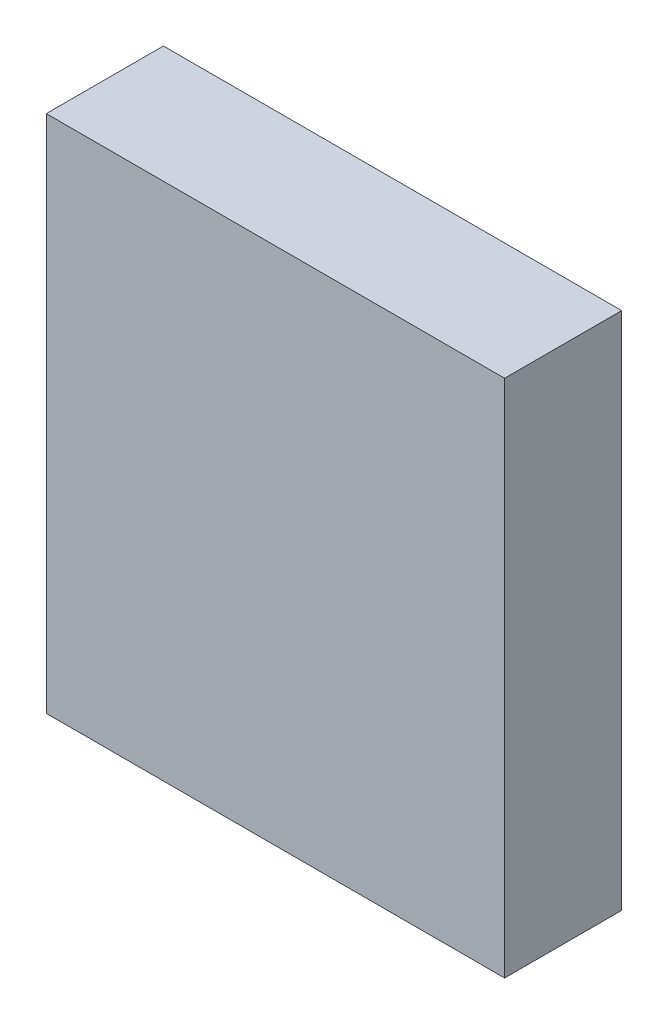
ISO-10303-21;
HEADER;
FILE_DESCRIPTION(('STEP AP214'),'2;1');
FILE_NAME('part.step','',(''),(''),'','','');
FILE_SCHEMA(('AUTOMOTIVE_DESIGN { 1 0 10303 214 1 1 1 1 }'));
ENDSEC;
DATA;
#1=APPLICATION_CONTEXT('core data for automotive mechanical design processes');
#2=APPLICATION_PROTOCOL_DEFINITION('international standard','automotive_design',2000,#1);
#3=PRODUCT_CONTEXT('',#1,'mechanical');
#4=PRODUCT('Part','Part','',(#3));
#5=PRODUCT_RELATED_PRODUCT_CATEGORY('part','',(#4));
#6=PRODUCT_DEFINITION_FORMATION('','',#4);
#7=PRODUCT_DEFINITION_CONTEXT('part definition',#1,'design');
#8=PRODUCT_DEFINITION('design','',#6,#7);
#9=PRODUCT_DEFINITION_SHAPE('','',#8);
#10=(LENGTH_UNIT() NAMED_UNIT(*) SI_UNIT(.MILLI.,.METRE.));
#11=(NAMED_UNIT(*) PLANE_ANGLE_UNIT() SI_UNIT($,.RADIAN.));
#12=(NAMED_UNIT(*) SI_UNIT($,.STERADIAN.) SOLID_ANGLE_UNIT());
#13=UNCERTAINTY_MEASURE_WITH_UNIT(LENGTH_MEASURE(1.E-05),#10,'distance_accuracy_value','');
#14=(GEOMETRIC_REPRESENTATION_CONTEXT(3) GLOBAL_UNCERTAINTY_ASSIGNED_CONTEXT((#13)) GLOBAL_UNIT_ASSIGNED_CONTEXT((#10,
#11,#12)) REPRESENTATION_CONTEXT('',''));
#15=CARTESIAN_POINT('',(0.,0.,0.));
#16=DIRECTION('',(0.,0.,1.));
#17=DIRECTION('',(1.,0.,0.));
#18=AXIS2_PLACEMENT_3D('',#15,#16,#17);
#19=CARTESIAN_POINT('',(2.25000058,2.54999998,1.15000024));
#20=DIRECTION('',(0.,0.,1.));
#21=DIRECTION('',(1.,0.,0.));
#22=AXIS2_PLACEMENT_3D('',#19,#20,#21);
#23=PLANE('',#22);
#24=DIRECTION('',(1.,0.,0.));
#25=VECTOR('',#24,1.);
#26=CARTESIAN_POINT('',(2.25000058,-2.54999998,1.15000024));
#27=LINE('',#26,#25);
#28=CARTESIAN_POINT('',(2.25000058,-2.54999998,1.15000024));
#29=VERTEX_POINT('',#28);
#30=CARTESIAN_POINT('',(-2.25000058,-2.54999998,1.15000024));
#31=VERTEX_POINT('',#30);
#32=EDGE_CURVE('E53',#29,#31,#27,.F.);
#33=ORIENTED_EDGE('',*,*,#32,.F.);
#34=DIRECTION('',(0.,1.,0.));
#35=VECTOR('',#34,1.);
#36=CARTESIAN_POINT('',(2.25000058,2.54999998,1.15000024));
#37=LINE('',#36,#35);
#38=CARTESIAN_POINT('',(2.25000058,2.54999998,1.15000024));
#39=VERTEX_POINT('',#38);
#40=EDGE_CURVE('E68',#39,#29,#37,.F.);
#41=ORIENTED_EDGE('',*,*,#40,.F.);
#42=DIRECTION('',(1.,0.,0.));
#43=VECTOR('',#42,1.);
#44=CARTESIAN_POINT('',(-2.25000058,2.54999998,1.15000024));
#45=LINE('',#44,#43);
#46=CARTESIAN_POINT('',(-2.25000058,2.54999998,1.15000024));
#47=VERTEX_POINT('',#46);
#48=EDGE_CURVE('E20',#47,#39,#45,.T.);
#49=ORIENTED_EDGE('',*,*,#48,.F.);
#50=DIRECTION('',(0.,1.,0.));
#51=VECTOR('',#50,1.);
#52=CARTESIAN_POINT('',(-2.25000058,-2.54999998,1.15000024));
#53=LINE('',#52,#51);
#54=EDGE_CURVE('E58',#31,#47,#53,.T.);
#55=ORIENTED_EDGE('',*,*,#54,.F.);
#56=EDGE_LOOP('',(#33,#41,#49,#55));
#57=FACE_BOUND('',#56,.T.);
#58=ADVANCED_FACE('F17',(#57),#23,.T.);
#59=CARTESIAN_POINT('',(-2.25000058,2.54999998,0.));
#60=DIRECTION('',(0.,1.,0.));
#61=DIRECTION('',(0.,0.,1.));
#62=AXIS2_PLACEMENT_3D('',#59,#60,#61);
#63=PLANE('',#62);
#64=DIRECTION('',(0.,0.,-1.));
#65=VECTOR('',#64,1.);
#66=CARTESIAN_POINT('',(2.25000058,2.54999998,0.));
#67=LINE('',#66,#65);
#68=CARTESIAN_POINT('',(2.25000058,2.54999998,0.));
#69=VERTEX_POINT('',#68);
#70=EDGE_CURVE('E79',#69,#39,#67,.F.);
#71=ORIENTED_EDGE('',*,*,#70,.F.);
#72=DIRECTION('',(1.,0.,0.));
#73=VECTOR('',#72,1.);
#74=CARTESIAN_POINT('',(2.25000058,2.54999998,0.));
#75=LINE('',#74,#73);
#76=CARTESIAN_POINT('',(-2.25000058,2.54999998,0.));
#77=VERTEX_POINT('',#76);
#78=EDGE_CURVE('E74',#69,#77,#75,.F.);
#79=ORIENTED_EDGE('',*,*,#78,.T.);
#80=DIRECTION('',(0.,0.,1.));
#81=VECTOR('',#80,1.);
#82=CARTESIAN_POINT('',(-2.25000058,2.54999998,0.));
#83=LINE('',#82,#81);
#84=EDGE_CURVE('E63',#47,#77,#83,.F.);
#85=ORIENTED_EDGE('',*,*,#84,.F.);
#86=ORIENTED_EDGE('',*,*,#48,.T.);
#87=EDGE_LOOP('',(#71,#79,#85,#86));
#88=FACE_BOUND('',#87,.T.);
#89=ADVANCED_FACE('F73',(#88),#63,.T.);
#90=CARTESIAN_POINT('',(-2.25000058,-2.54999998,0.));
#91=DIRECTION('',(-1.,0.,0.));
#92=DIRECTION('',(0.,0.,1.));
#93=AXIS2_PLACEMENT_3D('',#90,#91,#92);
#94=PLANE('',#93);
#95=ORIENTED_EDGE('',*,*,#84,.T.);
#96=DIRECTION('',(0.,1.,0.));
#97=VECTOR('',#96,1.);
#98=CARTESIAN_POINT('',(-2.25000058,2.54999998,0.));
#99=LINE('',#98,#97);
#100=CARTESIAN_POINT('',(-2.25000058,-2.54999998,0.));
#101=VERTEX_POINT('',#100);
#102=EDGE_CURVE('E84',#77,#101,#99,.F.);
#103=ORIENTED_EDGE('',*,*,#102,.T.);
#104=DIRECTION('',(0.,0.,-1.));
#105=VECTOR('',#104,1.);
#106=CARTESIAN_POINT('',(-2.25000058,-2.54999998,0.));
#107=LINE('',#106,#105);
#108=EDGE_CURVE('E65',#31,#101,#107,.T.);
#109=ORIENTED_EDGE('',*,*,#108,.F.);
#110=ORIENTED_EDGE('',*,*,#54,.T.);
#111=EDGE_LOOP('',(#95,#103,#109,#110));
#112=FACE_BOUND('',#111,.T.);
#113=ADVANCED_FACE('F60',(#112),#94,.T.);
#114=CARTESIAN_POINT('',(2.25000058,-2.54999998,0.));
#115=DIRECTION('',(0.,-1.,0.));
#116=DIRECTION('',(0.,0.,-1.));
#117=AXIS2_PLACEMENT_3D('',#114,#115,#116);
#118=PLANE('',#117);
#119=ORIENTED_EDGE('',*,*,#108,.T.);
#120=DIRECTION('',(1.,0.,0.));
#121=VECTOR('',#120,1.);
#122=CARTESIAN_POINT('',(2.25000058,-2.54999998,0.));
#123=LINE('',#122,#121);
#124=CARTESIAN_POINT('',(2.25000058,-2.54999998,0.));
#125=VERTEX_POINT('',#124);
#126=EDGE_CURVE('E26',#101,#125,#123,.T.);
#127=ORIENTED_EDGE('',*,*,#126,.T.);
#128=DIRECTION('',(0.,0.,-1.));
#129=VECTOR('',#128,1.);
#130=CARTESIAN_POINT('',(2.25000058,-2.54999998,0.));
#131=LINE('',#130,#129);
#132=EDGE_CURVE('E34',#29,#125,#131,.T.);
#133=ORIENTED_EDGE('',*,*,#132,.F.);
#134=ORIENTED_EDGE('',*,*,#32,.T.);
#135=EDGE_LOOP('',(#119,#127,#133,#134));
#136=FACE_BOUND('',#135,.T.);
#137=ADVANCED_FACE('F88',(#136),#118,.T.);
#138=CARTESIAN_POINT('',(2.25000058,2.54999998,0.));
#139=DIRECTION('',(1.,0.,0.));
#140=DIRECTION('',(0.,0.,-1.));
#141=AXIS2_PLACEMENT_3D('',#138,#139,#140);
#142=PLANE('',#141);
#143=ORIENTED_EDGE('',*,*,#132,.T.);
#144=DIRECTION('',(0.,1.,0.));
#145=VECTOR('',#144,1.);
#146=CARTESIAN_POINT('',(2.25000058,2.54999998,0.));
#147=LINE('',#146,#145);
#148=EDGE_CURVE('E11',#125,#69,#147,.T.);
#149=ORIENTED_EDGE('',*,*,#148,.T.);
#150=ORIENTED_EDGE('',*,*,#70,.T.);
#151=ORIENTED_EDGE('',*,*,#40,.T.);
#152=EDGE_LOOP('',(#143,#149,#150,#151));
#153=FACE_BOUND('',#152,.T.);
#154=ADVANCED_FACE('F91',(#153),#142,.T.);
#155=CARTESIAN_POINT('',(2.25000058,2.54999998,0.));
#156=DIRECTION('',(0.,0.,1.));
#157=DIRECTION('',(1.,0.,0.));
#158=AXIS2_PLACEMENT_3D('',#155,#156,#157);
#159=PLANE('',#158);
#160=ORIENTED_EDGE('',*,*,#126,.F.);
#161=ORIENTED_EDGE('',*,*,#102,.F.);
#162=ORIENTED_EDGE('',*,*,#78,.F.);
#163=ORIENTED_EDGE('',*,*,#148,.F.);
#164=EDGE_LOOP('',(#160,#161,#162,#163));
#165=FACE_BOUND('',#164,.T.);
#166=ADVANCED_FACE('F90',(#165),#159,.F.);
#167=CLOSED_SHELL('',(#58,#89,#113,#137,#154,#166));
#168=MANIFOLD_SOLID_BREP('B1',#167);
#169=ADVANCED_BREP_SHAPE_REPRESENTATION('',(#18,#168),#14);
#170=SHAPE_DEFINITION_REPRESENTATION(#9,#169);
ENDSEC;
END-ISO-10303-21;
